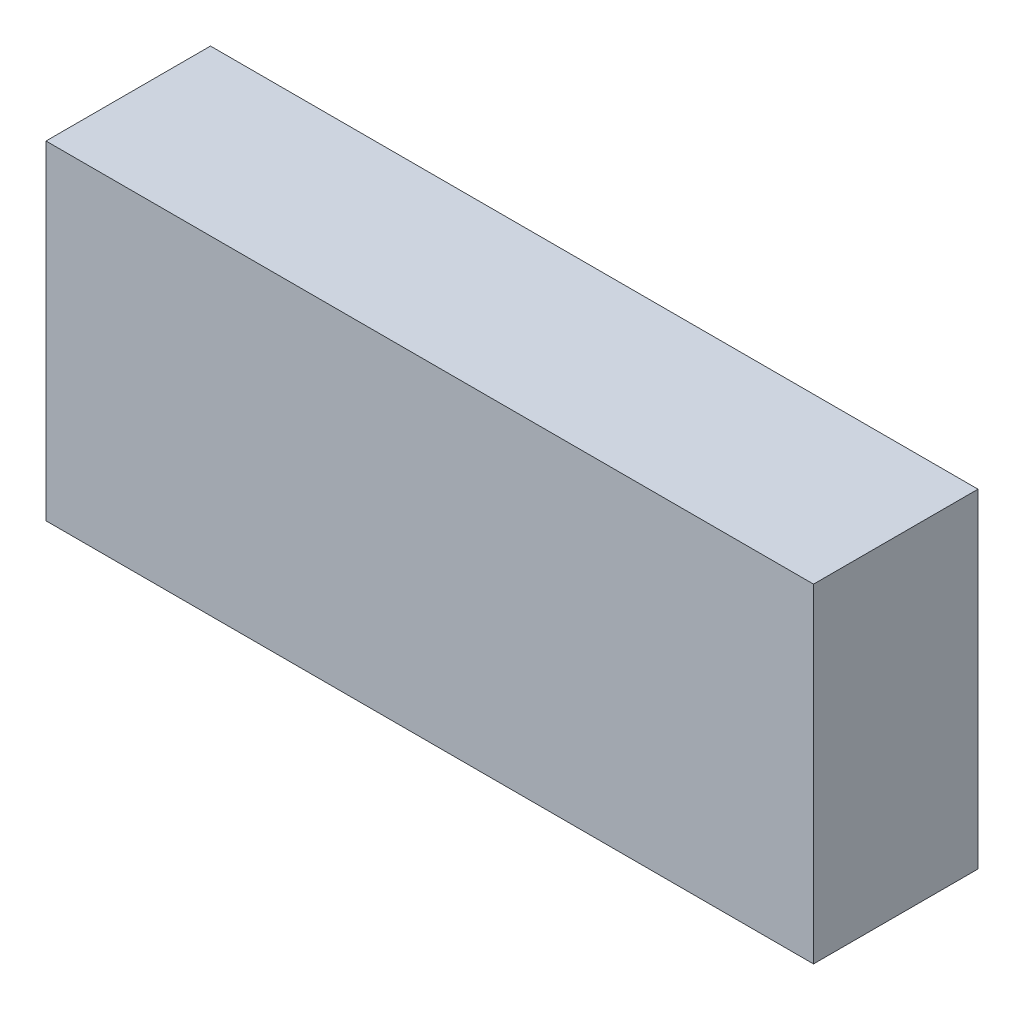
ISO-10303-21;
HEADER;
FILE_DESCRIPTION(('STEP AP214'),'2;1');
FILE_NAME('part.step','',(''),(''),'','','');
FILE_SCHEMA(('AUTOMOTIVE_DESIGN { 1 0 10303 214 1 1 1 1 }'));
ENDSEC;
DATA;
#1=APPLICATION_CONTEXT('core data for automotive mechanical design processes');
#2=APPLICATION_PROTOCOL_DEFINITION('international standard','automotive_design',2000,#1);
#3=PRODUCT_CONTEXT('',#1,'mechanical');
#4=PRODUCT('Part','Part','',(#3));
#5=PRODUCT_RELATED_PRODUCT_CATEGORY('part','',(#4));
#6=PRODUCT_DEFINITION_FORMATION('','',#4);
#7=PRODUCT_DEFINITION_CONTEXT('part definition',#1,'design');
#8=PRODUCT_DEFINITION('design','',#6,#7);
#9=PRODUCT_DEFINITION_SHAPE('','',#8);
#10=(LENGTH_UNIT() NAMED_UNIT(*) SI_UNIT(.MILLI.,.METRE.));
#11=(NAMED_UNIT(*) PLANE_ANGLE_UNIT() SI_UNIT($,.RADIAN.));
#12=(NAMED_UNIT(*) SI_UNIT($,.STERADIAN.) SOLID_ANGLE_UNIT());
#13=UNCERTAINTY_MEASURE_WITH_UNIT(LENGTH_MEASURE(1.E-05),#10,'distance_accuracy_value','');
#14=(GEOMETRIC_REPRESENTATION_CONTEXT(3) GLOBAL_UNCERTAINTY_ASSIGNED_CONTEXT((#13)) GLOBAL_UNIT_ASSIGNED_CONTEXT((#10,
#11,#12)) REPRESENTATION_CONTEXT('',''));
#15=CARTESIAN_POINT('',(0.,0.,0.));
#16=DIRECTION('',(0.,0.,1.));
#17=DIRECTION('',(1.,0.,0.));
#18=AXIS2_PLACEMENT_3D('',#15,#16,#17);
#19=CARTESIAN_POINT('',(0.,30.,0.));
#20=DIRECTION('',(1.,0.,0.));
#21=DIRECTION('',(0.,0.,-1.));
#22=AXIS2_PLACEMENT_3D('',#19,#20,#21);
#23=PLANE('',#22);
#24=DIRECTION('',(0.,0.,1.));
#25=VECTOR('',#24,1.);
#26=CARTESIAN_POINT('',(0.,0.,0.));
#27=LINE('',#26,#25);
#28=CARTESIAN_POINT('',(0.,0.,-15.));
#29=VERTEX_POINT('',#28);
#30=CARTESIAN_POINT('',(0.,0.,0.));
#31=VERTEX_POINT('',#30);
#32=EDGE_CURVE('E96',#29,#31,#27,.T.);
#33=ORIENTED_EDGE('',*,*,#32,.T.);
#34=DIRECTION('',(0.,-1.,0.));
#35=VECTOR('',#34,1.);
#36=CARTESIAN_POINT('',(0.,30.,0.));
#37=LINE('',#36,#35);
#38=CARTESIAN_POINT('',(0.,30.,0.));
#39=VERTEX_POINT('',#38);
#40=EDGE_CURVE('E11',#39,#31,#37,.T.);
#41=ORIENTED_EDGE('',*,*,#40,.F.);
#42=DIRECTION('',(0.,0.,1.));
#43=VECTOR('',#42,1.);
#44=CARTESIAN_POINT('',(0.,30.,0.));
#45=LINE('',#44,#43);
#46=CARTESIAN_POINT('',(0.,30.,-15.));
#47=VERTEX_POINT('',#46);
#48=EDGE_CURVE('E84',#47,#39,#45,.T.);
#49=ORIENTED_EDGE('',*,*,#48,.F.);
#50=DIRECTION('',(0.,-1.,0.));
#51=VECTOR('',#50,1.);
#52=CARTESIAN_POINT('',(0.,30.,-15.));
#53=LINE('',#52,#51);
#54=EDGE_CURVE('E92',#47,#29,#53,.T.);
#55=ORIENTED_EDGE('',*,*,#54,.T.);
#56=EDGE_LOOP('',(#33,#41,#49,#55));
#57=FACE_BOUND('',#56,.T.);
#58=ADVANCED_FACE('F33',(#57),#23,.F.);
#59=CARTESIAN_POINT('',(0.,30.,0.));
#60=DIRECTION('',(0.,0.,-1.));
#61=DIRECTION('',(-1.,0.,0.));
#62=AXIS2_PLACEMENT_3D('',#59,#60,#61);
#63=PLANE('',#62);
#64=DIRECTION('',(1.,0.,0.));
#65=VECTOR('',#64,1.);
#66=CARTESIAN_POINT('',(0.,0.,0.));
#67=LINE('',#66,#65);
#68=CARTESIAN_POINT('',(70.,0.,0.));
#69=VERTEX_POINT('',#68);
#70=EDGE_CURVE('E88',#31,#69,#67,.T.);
#71=ORIENTED_EDGE('',*,*,#70,.T.);
#72=DIRECTION('',(0.,-1.,0.));
#73=VECTOR('',#72,1.);
#74=CARTESIAN_POINT('',(70.,30.,0.));
#75=LINE('',#74,#73);
#76=CARTESIAN_POINT('',(70.,30.,0.));
#77=VERTEX_POINT('',#76);
#78=EDGE_CURVE('E41',#77,#69,#75,.T.);
#79=ORIENTED_EDGE('',*,*,#78,.F.);
#80=DIRECTION('',(1.,0.,0.));
#81=VECTOR('',#80,1.);
#82=CARTESIAN_POINT('',(0.,30.,0.));
#83=LINE('',#82,#81);
#84=EDGE_CURVE('E79',#39,#77,#83,.T.);
#85=ORIENTED_EDGE('',*,*,#84,.F.);
#86=ORIENTED_EDGE('',*,*,#40,.T.);
#87=EDGE_LOOP('',(#71,#79,#85,#86));
#88=FACE_BOUND('',#87,.T.);
#89=ADVANCED_FACE('F87',(#88),#63,.F.);
#90=CARTESIAN_POINT('',(70.,30.,0.));
#91=DIRECTION('',(-1.,0.,0.));
#92=DIRECTION('',(0.,0.,1.));
#93=AXIS2_PLACEMENT_3D('',#90,#91,#92);
#94=PLANE('',#93);
#95=DIRECTION('',(0.,0.,-1.));
#96=VECTOR('',#95,1.);
#97=CARTESIAN_POINT('',(70.,0.,0.));
#98=LINE('',#97,#96);
#99=CARTESIAN_POINT('',(70.,0.,-15.));
#100=VERTEX_POINT('',#99);
#101=EDGE_CURVE('E66',#69,#100,#98,.T.);
#102=ORIENTED_EDGE('',*,*,#101,.T.);
#103=DIRECTION('',(0.,-1.,0.));
#104=VECTOR('',#103,1.);
#105=CARTESIAN_POINT('',(70.,30.,-15.));
#106=LINE('',#105,#104);
#107=CARTESIAN_POINT('',(70.,30.,-15.));
#108=VERTEX_POINT('',#107);
#109=EDGE_CURVE('E89',#108,#100,#106,.T.);
#110=ORIENTED_EDGE('',*,*,#109,.F.);
#111=DIRECTION('',(0.,0.,-1.));
#112=VECTOR('',#111,1.);
#113=CARTESIAN_POINT('',(70.,30.,0.));
#114=LINE('',#113,#112);
#115=EDGE_CURVE('E82',#77,#108,#114,.T.);
#116=ORIENTED_EDGE('',*,*,#115,.F.);
#117=ORIENTED_EDGE('',*,*,#78,.T.);
#118=EDGE_LOOP('',(#102,#110,#116,#117));
#119=FACE_BOUND('',#118,.T.);
#120=ADVANCED_FACE('F90',(#119),#94,.F.);
#121=CARTESIAN_POINT('',(0.,30.,-15.));
#122=DIRECTION('',(0.,0.,1.));
#123=DIRECTION('',(1.,0.,0.));
#124=AXIS2_PLACEMENT_3D('',#121,#122,#123);
#125=PLANE('',#124);
#126=DIRECTION('',(-1.,0.,0.));
#127=VECTOR('',#126,1.);
#128=CARTESIAN_POINT('',(0.,0.,-15.));
#129=LINE('',#128,#127);
#130=EDGE_CURVE('E72',#100,#29,#129,.T.);
#131=ORIENTED_EDGE('',*,*,#130,.T.);
#132=ORIENTED_EDGE('',*,*,#54,.F.);
#133=DIRECTION('',(-1.,0.,0.));
#134=VECTOR('',#133,1.);
#135=CARTESIAN_POINT('',(0.,30.,-15.));
#136=LINE('',#135,#134);
#137=EDGE_CURVE('E49',#108,#47,#136,.T.);
#138=ORIENTED_EDGE('',*,*,#137,.F.);
#139=ORIENTED_EDGE('',*,*,#109,.T.);
#140=EDGE_LOOP('',(#131,#132,#138,#139));
#141=FACE_BOUND('',#140,.T.);
#142=ADVANCED_FACE('F103',(#141),#125,.F.);
#143=CARTESIAN_POINT('',(0.,30.,0.));
#144=DIRECTION('',(0.,-1.,0.));
#145=DIRECTION('',(0.,0.,-1.));
#146=AXIS2_PLACEMENT_3D('',#143,#144,#145);
#147=PLANE('',#146);
#148=ORIENTED_EDGE('',*,*,#48,.T.);
#149=ORIENTED_EDGE('',*,*,#84,.T.);
#150=ORIENTED_EDGE('',*,*,#115,.T.);
#151=ORIENTED_EDGE('',*,*,#137,.T.);
#152=EDGE_LOOP('',(#148,#149,#150,#151));
#153=FACE_BOUND('',#152,.T.);
#154=ADVANCED_FACE('F80',(#153),#147,.F.);
#155=CARTESIAN_POINT('',(0.,0.,0.));
#156=DIRECTION('',(0.,-1.,0.));
#157=DIRECTION('',(0.,0.,-1.));
#158=AXIS2_PLACEMENT_3D('',#155,#156,#157);
#159=PLANE('',#158);
#160=ORIENTED_EDGE('',*,*,#32,.F.);
#161=ORIENTED_EDGE('',*,*,#130,.F.);
#162=ORIENTED_EDGE('',*,*,#101,.F.);
#163=ORIENTED_EDGE('',*,*,#70,.F.);
#164=EDGE_LOOP('',(#160,#161,#162,#163));
#165=FACE_BOUND('',#164,.T.);
#166=ADVANCED_FACE('F106',(#165),#159,.T.);
#167=CLOSED_SHELL('',(#58,#89,#120,#142,#154,#166));
#168=MANIFOLD_SOLID_BREP('B2',#167);
#169=ADVANCED_BREP_SHAPE_REPRESENTATION('',(#18,#168),#14);
#170=SHAPE_DEFINITION_REPRESENTATION(#9,#169);
ENDSEC;
END-ISO-10303-21;
